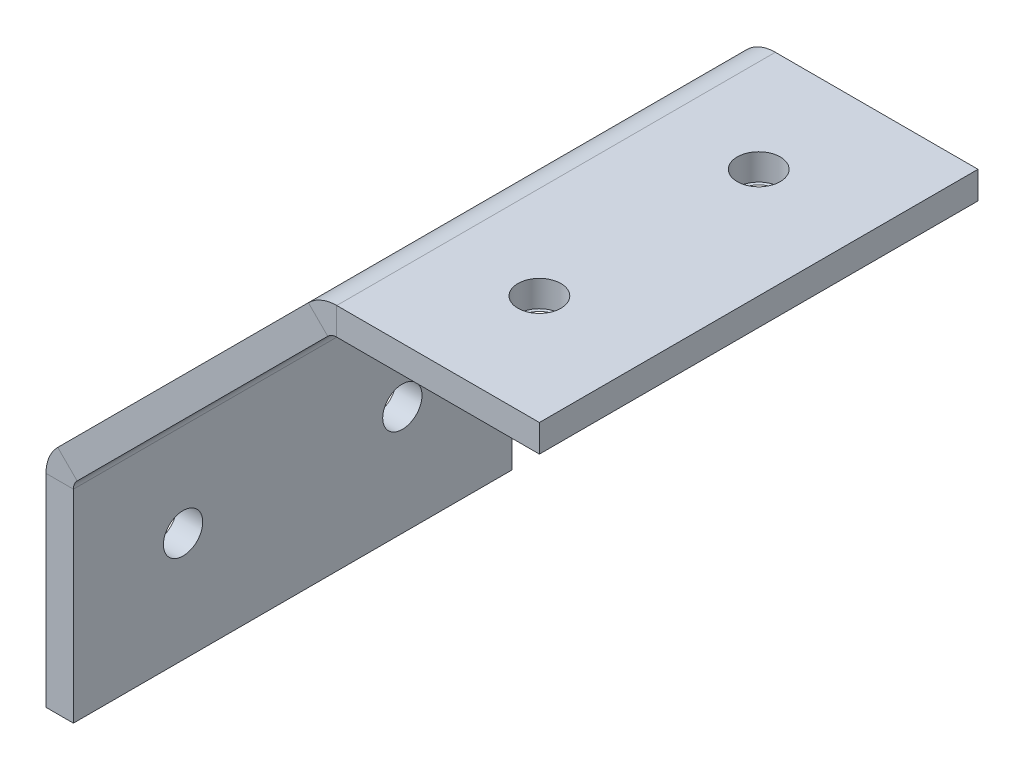
ISO-10303-21;
HEADER;
FILE_DESCRIPTION(('STEP AP214'),'2;1');
FILE_NAME('part.step','',(''),(''),'','','');
FILE_SCHEMA(('AUTOMOTIVE_DESIGN { 1 0 10303 214 1 1 1 1 }'));
ENDSEC;
DATA;
#1=APPLICATION_CONTEXT('core data for automotive mechanical design processes');
#2=APPLICATION_PROTOCOL_DEFINITION('international standard','automotive_design',2000,#1);
#3=PRODUCT_CONTEXT('',#1,'mechanical');
#4=PRODUCT('Part','Part','',(#3));
#5=PRODUCT_RELATED_PRODUCT_CATEGORY('part','',(#4));
#6=PRODUCT_DEFINITION_FORMATION('','',#4);
#7=PRODUCT_DEFINITION_CONTEXT('part definition',#1,'design');
#8=PRODUCT_DEFINITION('design','',#6,#7);
#9=PRODUCT_DEFINITION_SHAPE('','',#8);
#10=(LENGTH_UNIT() NAMED_UNIT(*) SI_UNIT(.MILLI.,.METRE.));
#11=(NAMED_UNIT(*) PLANE_ANGLE_UNIT() SI_UNIT($,.RADIAN.));
#12=(NAMED_UNIT(*) SI_UNIT($,.STERADIAN.) SOLID_ANGLE_UNIT());
#13=UNCERTAINTY_MEASURE_WITH_UNIT(LENGTH_MEASURE(1.E-05),#10,'distance_accuracy_value','');
#14=(GEOMETRIC_REPRESENTATION_CONTEXT(3) GLOBAL_UNCERTAINTY_ASSIGNED_CONTEXT((#13)) GLOBAL_UNIT_ASSIGNED_CONTEXT((#10,
#11,#12)) REPRESENTATION_CONTEXT('',''));
#15=CARTESIAN_POINT('',(0.,0.,0.));
#16=DIRECTION('',(0.,0.,1.));
#17=DIRECTION('',(1.,0.,0.));
#18=AXIS2_PLACEMENT_3D('',#15,#16,#17);
#19=CARTESIAN_POINT('',(16.8376737403113,0.,25.4));
#20=DIRECTION('',(0.,0.,1.));
#21=DIRECTION('',(1.,0.,0.));
#22=AXIS2_PLACEMENT_3D('',#19,#20,#21);
#23=PLANE('',#22);
#24=DIRECTION('',(0.,-1.,0.));
#25=VECTOR('',#24,1.);
#26=CARTESIAN_POINT('',(16.8376737403113,0.,25.4));
#27=LINE('',#26,#25);
#28=CARTESIAN_POINT('',(16.8376737403113,0.,25.4));
#29=VERTEX_POINT('',#28);
#30=CARTESIAN_POINT('',(16.8376737403113,-1.5875,25.4));
#31=VERTEX_POINT('',#30);
#32=EDGE_CURVE('E13',#29,#31,#27,.T.);
#33=ORIENTED_EDGE('',*,*,#32,.F.);
#34=CARTESIAN_POINT('',(16.8376737403113,-2.3241,25.4));
#35=DIRECTION('',(0.,0.,-1.));
#36=DIRECTION('',(-1.,0.,0.));
#37=AXIS2_PLACEMENT_3D('',#34,#35,#36);
#38=CIRCLE('',#37,2.3241);
#39=CARTESIAN_POINT('',(15.1942868701557,-0.680713129844343,25.4));
#40=VERTEX_POINT('',#39);
#41=EDGE_CURVE('E157',#29,#40,#38,.F.);
#42=ORIENTED_EDGE('',*,*,#41,.T.);
#43=DIRECTION('',(-0.707106781186547,0.707106781186548,0.));
#44=VECTOR('',#43,1.);
#45=CARTESIAN_POINT('',(16.3168188852893,-1.80324514497799,25.4));
#46=LINE('',#45,#44);
#47=CARTESIAN_POINT('',(16.3168188852893,-1.80324514497799,25.4));
#48=VERTEX_POINT('',#47);
#49=EDGE_CURVE('E54',#48,#40,#46,.T.);
#50=ORIENTED_EDGE('',*,*,#49,.F.);
#51=CARTESIAN_POINT('',(16.8376737403113,-2.3241,25.4));
#52=DIRECTION('',(0.,0.,1.));
#53=DIRECTION('',(1.,0.,0.));
#54=AXIS2_PLACEMENT_3D('',#51,#52,#53);
#55=CIRCLE('',#54,0.7366);
#56=EDGE_CURVE('E307',#31,#48,#55,.T.);
#57=ORIENTED_EDGE('',*,*,#56,.F.);
#58=EDGE_LOOP('',(#33,#42,#50,#57));
#59=FACE_BOUND('',#58,.T.);
#60=ADVANCED_FACE('F45',(#59),#23,.T.);
#61=CARTESIAN_POINT('',(16.3168188852893,-1.80324514497799,25.4));
#62=DIRECTION('',(0.,0.,1.));
#63=DIRECTION('',(1.,0.,0.));
#64=AXIS2_PLACEMENT_3D('',#61,#62,#63);
#65=PLANE('',#64);
#66=DIRECTION('',(-1.,0.,0.));
#67=VECTOR('',#66,1.);
#68=CARTESIAN_POINT('',(22.225,0.,25.4));
#69=LINE('',#68,#67);
#70=CARTESIAN_POINT('',(28.575,0.,25.4));
#71=VERTEX_POINT('',#70);
#72=EDGE_CURVE('E162',#71,#29,#69,.T.);
#73=ORIENTED_EDGE('',*,*,#72,.T.);
#74=ORIENTED_EDGE('',*,*,#32,.T.);
#75=DIRECTION('',(1.,0.,0.));
#76=VECTOR('',#75,1.);
#77=CARTESIAN_POINT('',(15.875,-1.5875,25.4));
#78=LINE('',#77,#76);
#79=CARTESIAN_POINT('',(28.575,-1.5875,25.4));
#80=VERTEX_POINT('',#79);
#81=EDGE_CURVE('E309',#80,#31,#78,.F.);
#82=ORIENTED_EDGE('',*,*,#81,.F.);
#83=DIRECTION('',(0.,-1.,0.));
#84=VECTOR('',#83,1.);
#85=CARTESIAN_POINT('',(28.575,0.,25.4));
#86=LINE('',#85,#84);
#87=EDGE_CURVE('E312',#71,#80,#86,.T.);
#88=ORIENTED_EDGE('',*,*,#87,.F.);
#89=EDGE_LOOP('',(#73,#74,#82,#88));
#90=FACE_BOUND('',#89,.T.);
#91=ADVANCED_FACE('F318',(#90),#65,.T.);
#92=CARTESIAN_POINT('',(15.1942868701557,-0.680713129844343,0.));
#93=DIRECTION('',(0.,0.,-1.));
#94=DIRECTION('',(-1.,0.,0.));
#95=AXIS2_PLACEMENT_3D('',#92,#93,#94);
#96=PLANE('',#95);
#97=DIRECTION('',(0.707106781186547,-0.707106781186548,0.));
#98=VECTOR('',#97,1.);
#99=CARTESIAN_POINT('',(15.1942868701557,-0.680713129844343,0.));
#100=LINE('',#99,#98);
#101=CARTESIAN_POINT('',(15.1942868701557,-0.680713129844343,0.));
#102=VERTEX_POINT('',#101);
#103=CARTESIAN_POINT('',(16.3168188852893,-1.80324514497799,0.));
#104=VERTEX_POINT('',#103);
#105=EDGE_CURVE('E154',#102,#104,#100,.T.);
#106=ORIENTED_EDGE('',*,*,#105,.F.);
#107=CARTESIAN_POINT('',(16.8376737403113,-2.3241,0.));
#108=DIRECTION('',(0.,0.,-1.));
#109=DIRECTION('',(-1.,0.,0.));
#110=AXIS2_PLACEMENT_3D('',#107,#108,#109);
#111=CIRCLE('',#110,2.3241);
#112=CARTESIAN_POINT('',(16.8376737403113,0.,0.));
#113=VERTEX_POINT('',#112);
#114=EDGE_CURVE('E169',#113,#102,#111,.F.);
#115=ORIENTED_EDGE('',*,*,#114,.F.);
#116=DIRECTION('',(0.,1.,0.));
#117=VECTOR('',#116,1.);
#118=CARTESIAN_POINT('',(16.8376737403113,-1.5875,0.));
#119=LINE('',#118,#117);
#120=CARTESIAN_POINT('',(16.8376737403113,-1.5875,0.));
#121=VERTEX_POINT('',#120);
#122=EDGE_CURVE('E245',#121,#113,#119,.T.);
#123=ORIENTED_EDGE('',*,*,#122,.F.);
#124=CARTESIAN_POINT('',(16.8376737403113,-2.3241,0.));
#125=DIRECTION('',(0.,0.,1.));
#126=DIRECTION('',(1.,0.,0.));
#127=AXIS2_PLACEMENT_3D('',#124,#125,#126);
#128=CIRCLE('',#127,0.7366);
#129=EDGE_CURVE('E194',#121,#104,#128,.T.);
#130=ORIENTED_EDGE('',*,*,#129,.T.);
#131=EDGE_LOOP('',(#106,#115,#123,#130));
#132=FACE_BOUND('',#131,.T.);
#133=ADVANCED_FACE('F323',(#132),#96,.T.);
#134=CARTESIAN_POINT('',(16.8376737403113,-1.5875,0.));
#135=DIRECTION('',(0.,0.,-1.));
#136=DIRECTION('',(-1.,0.,0.));
#137=AXIS2_PLACEMENT_3D('',#134,#135,#136);
#138=PLANE('',#137);
#139=DIRECTION('',(-0.707106781186548,-0.707106781186548,0.));
#140=VECTOR('',#139,1.);
#141=CARTESIAN_POINT('',(15.875,0.,0.));
#142=LINE('',#141,#140);
#143=CARTESIAN_POINT('',(0.680713129844338,-15.1942868701557,0.));
#144=VERTEX_POINT('',#143);
#145=EDGE_CURVE('E207',#102,#144,#142,.T.);
#146=ORIENTED_EDGE('',*,*,#145,.F.);
#147=ORIENTED_EDGE('',*,*,#105,.T.);
#148=DIRECTION('',(-0.707106781186548,-0.707106781186548,0.));
#149=VECTOR('',#148,1.);
#150=CARTESIAN_POINT('',(16.9975320151336,-1.12253201513364,0.));
#151=LINE('',#150,#149);
#152=CARTESIAN_POINT('',(1.80324514497799,-16.3168188852893,0.));
#153=VERTEX_POINT('',#152);
#154=EDGE_CURVE('E192',#104,#153,#151,.T.);
#155=ORIENTED_EDGE('',*,*,#154,.T.);
#156=DIRECTION('',(-0.707106781186549,0.707106781186546,0.));
#157=VECTOR('',#156,1.);
#158=CARTESIAN_POINT('',(1.80324514497799,-16.3168188852893,0.));
#159=LINE('',#158,#157);
#160=EDGE_CURVE('E104',#153,#144,#159,.T.);
#161=ORIENTED_EDGE('',*,*,#160,.T.);
#162=EDGE_LOOP('',(#146,#147,#155,#161));
#163=FACE_BOUND('',#162,.T.);
#164=ADVANCED_FACE('F325',(#163),#138,.T.);
#165=CARTESIAN_POINT('',(0.680713129844338,-15.1942868701557,25.4));
#166=DIRECTION('',(0.,0.,1.));
#167=DIRECTION('',(1.,0.,0.));
#168=AXIS2_PLACEMENT_3D('',#165,#166,#167);
#169=PLANE('',#168);
#170=DIRECTION('',(0.707106781186549,-0.707106781186546,0.));
#171=VECTOR('',#170,1.);
#172=CARTESIAN_POINT('',(0.680713129844338,-15.1942868701557,25.4));
#173=LINE('',#172,#171);
#174=CARTESIAN_POINT('',(0.680713129844338,-15.1942868701557,25.4));
#175=VERTEX_POINT('',#174);
#176=CARTESIAN_POINT('',(1.80324514497799,-16.3168188852893,25.4));
#177=VERTEX_POINT('',#176);
#178=EDGE_CURVE('E243',#175,#177,#173,.T.);
#179=ORIENTED_EDGE('',*,*,#178,.F.);
#180=CARTESIAN_POINT('',(2.3241,-16.8376737403113,25.4));
#181=DIRECTION('',(0.,0.,-1.));
#182=DIRECTION('',(-1.,0.,0.));
#183=AXIS2_PLACEMENT_3D('',#180,#181,#182);
#184=CIRCLE('',#183,2.3241);
#185=CARTESIAN_POINT('',(0.,-16.8376737403113,25.4));
#186=VERTEX_POINT('',#185);
#187=EDGE_CURVE('E177',#175,#186,#184,.F.);
#188=ORIENTED_EDGE('',*,*,#187,.T.);
#189=DIRECTION('',(-1.,0.,0.));
#190=VECTOR('',#189,1.);
#191=CARTESIAN_POINT('',(1.5875,-16.8376737403113,25.4));
#192=LINE('',#191,#190);
#193=CARTESIAN_POINT('',(1.5875,-16.8376737403113,25.4));
#194=VERTEX_POINT('',#193);
#195=EDGE_CURVE('E63',#194,#186,#192,.T.);
#196=ORIENTED_EDGE('',*,*,#195,.F.);
#197=CARTESIAN_POINT('',(2.3241,-16.8376737403113,25.4));
#198=DIRECTION('',(0.,0.,1.));
#199=DIRECTION('',(1.,0.,0.));
#200=AXIS2_PLACEMENT_3D('',#197,#198,#199);
#201=CIRCLE('',#200,0.7366);
#202=EDGE_CURVE('E303',#177,#194,#201,.T.);
#203=ORIENTED_EDGE('',*,*,#202,.F.);
#204=EDGE_LOOP('',(#179,#188,#196,#203));
#205=FACE_BOUND('',#204,.T.);
#206=ADVANCED_FACE('F354',(#205),#169,.T.);
#207=CARTESIAN_POINT('',(1.5875,-16.8376737403113,25.4));
#208=DIRECTION('',(0.,0.,1.));
#209=DIRECTION('',(1.,0.,0.));
#210=AXIS2_PLACEMENT_3D('',#207,#208,#209);
#211=PLANE('',#210);
#212=DIRECTION('',(-0.707106781186548,-0.707106781186548,0.));
#213=VECTOR('',#212,1.);
#214=CARTESIAN_POINT('',(15.875,0.,25.4));
#215=LINE('',#214,#213);
#216=EDGE_CURVE('E146',#40,#175,#215,.T.);
#217=ORIENTED_EDGE('',*,*,#216,.T.);
#218=ORIENTED_EDGE('',*,*,#178,.T.);
#219=DIRECTION('',(-0.707106781186548,-0.707106781186548,0.));
#220=VECTOR('',#219,1.);
#221=CARTESIAN_POINT('',(16.9975320151336,-1.12253201513364,25.4));
#222=LINE('',#221,#220);
#223=EDGE_CURVE('E149',#48,#177,#222,.T.);
#224=ORIENTED_EDGE('',*,*,#223,.F.);
#225=ORIENTED_EDGE('',*,*,#49,.T.);
#226=EDGE_LOOP('',(#217,#218,#224,#225));
#227=FACE_BOUND('',#226,.T.);
#228=ADVANCED_FACE('F144',(#227),#211,.T.);
#229=CARTESIAN_POINT('',(0.,-16.8376737403113,0.));
#230=DIRECTION('',(0.,0.,-1.));
#231=DIRECTION('',(-1.,0.,0.));
#232=AXIS2_PLACEMENT_3D('',#229,#230,#231);
#233=PLANE('',#232);
#234=DIRECTION('',(1.,0.,0.));
#235=VECTOR('',#234,1.);
#236=CARTESIAN_POINT('',(0.,-16.8376737403113,0.));
#237=LINE('',#236,#235);
#238=CARTESIAN_POINT('',(0.,-16.8376737403113,0.));
#239=VERTEX_POINT('',#238);
#240=CARTESIAN_POINT('',(1.5875,-16.8376737403113,0.));
#241=VERTEX_POINT('',#240);
#242=EDGE_CURVE('E111',#239,#241,#237,.T.);
#243=ORIENTED_EDGE('',*,*,#242,.F.);
#244=CARTESIAN_POINT('',(2.3241,-16.8376737403113,0.));
#245=DIRECTION('',(0.,0.,-1.));
#246=DIRECTION('',(-1.,0.,0.));
#247=AXIS2_PLACEMENT_3D('',#244,#245,#246);
#248=CIRCLE('',#247,2.3241);
#249=EDGE_CURVE('E209',#144,#239,#248,.F.);
#250=ORIENTED_EDGE('',*,*,#249,.F.);
#251=ORIENTED_EDGE('',*,*,#160,.F.);
#252=CARTESIAN_POINT('',(2.3241,-16.8376737403113,0.));
#253=DIRECTION('',(0.,0.,1.));
#254=DIRECTION('',(1.,0.,0.));
#255=AXIS2_PLACEMENT_3D('',#252,#253,#254);
#256=CIRCLE('',#255,0.7366);
#257=EDGE_CURVE('E190',#153,#241,#256,.T.);
#258=ORIENTED_EDGE('',*,*,#257,.T.);
#259=EDGE_LOOP('',(#243,#250,#251,#258));
#260=FACE_BOUND('',#259,.T.);
#261=ADVANCED_FACE('F338',(#260),#233,.T.);
#262=CARTESIAN_POINT('',(1.80324514497799,-16.3168188852893,0.));
#263=DIRECTION('',(0.,0.,-1.));
#264=DIRECTION('',(-1.,0.,0.));
#265=AXIS2_PLACEMENT_3D('',#262,#263,#264);
#266=PLANE('',#265);
#267=DIRECTION('',(0.,-1.,0.));
#268=VECTOR('',#267,1.);
#269=CARTESIAN_POINT('',(0.,-15.875,0.));
#270=LINE('',#269,#268);
#271=CARTESIAN_POINT('',(0.,-28.575,0.));
#272=VERTEX_POINT('',#271);
#273=EDGE_CURVE('E211',#239,#272,#270,.T.);
#274=ORIENTED_EDGE('',*,*,#273,.F.);
#275=ORIENTED_EDGE('',*,*,#242,.T.);
#276=DIRECTION('',(0.,-1.,0.));
#277=VECTOR('',#276,1.);
#278=CARTESIAN_POINT('',(1.5875,-15.875,0.));
#279=LINE('',#278,#277);
#280=CARTESIAN_POINT('',(1.5875,-28.575,0.));
#281=VERTEX_POINT('',#280);
#282=EDGE_CURVE('E187',#241,#281,#279,.T.);
#283=ORIENTED_EDGE('',*,*,#282,.T.);
#284=DIRECTION('',(-1.,0.,0.));
#285=VECTOR('',#284,1.);
#286=CARTESIAN_POINT('',(1.5875,-28.575,0.));
#287=LINE('',#286,#285);
#288=EDGE_CURVE('E184',#281,#272,#287,.T.);
#289=ORIENTED_EDGE('',*,*,#288,.T.);
#290=EDGE_LOOP('',(#274,#275,#283,#289));
#291=FACE_BOUND('',#290,.T.);
#292=ADVANCED_FACE('F346',(#291),#266,.T.);
#293=CARTESIAN_POINT('',(1.5875,-28.575,25.4));
#294=DIRECTION('',(0.,-1.,0.));
#295=DIRECTION('',(0.,0.,-1.));
#296=AXIS2_PLACEMENT_3D('',#293,#294,#295);
#297=PLANE('',#296);
#298=ORIENTED_EDGE('',*,*,#288,.F.);
#299=DIRECTION('',(0.,0.,-1.));
#300=VECTOR('',#299,1.);
#301=CARTESIAN_POINT('',(1.5875,-28.575,25.4));
#302=LINE('',#301,#300);
#303=CARTESIAN_POINT('',(1.5875,-28.575,25.4));
#304=VERTEX_POINT('',#303);
#305=EDGE_CURVE('E234',#304,#281,#302,.T.);
#306=ORIENTED_EDGE('',*,*,#305,.F.);
#307=DIRECTION('',(-1.,0.,0.));
#308=VECTOR('',#307,1.);
#309=CARTESIAN_POINT('',(1.5875,-28.575,25.4));
#310=LINE('',#309,#308);
#311=CARTESIAN_POINT('',(0.,-28.575,25.4));
#312=VERTEX_POINT('',#311);
#313=EDGE_CURVE('E297',#304,#312,#310,.T.);
#314=ORIENTED_EDGE('',*,*,#313,.T.);
#315=DIRECTION('',(0.,0.,-1.));
#316=VECTOR('',#315,1.);
#317=CARTESIAN_POINT('',(0.,-28.575,25.4));
#318=LINE('',#317,#316);
#319=EDGE_CURVE('E237',#312,#272,#318,.T.);
#320=ORIENTED_EDGE('',*,*,#319,.T.);
#321=EDGE_LOOP('',(#298,#306,#314,#320));
#322=FACE_BOUND('',#321,.T.);
#323=ADVANCED_FACE('F349',(#322),#297,.T.);
#324=CARTESIAN_POINT('',(1.5875,-15.875,25.4));
#325=DIRECTION('',(1.,0.,0.));
#326=DIRECTION('',(0.,1.,0.));
#327=AXIS2_PLACEMENT_3D('',#324,#325,#326);
#328=PLANE('',#327);
#329=CARTESIAN_POINT('',(1.5875,-22.225,19.05));
#330=DIRECTION('',(1.,0.,0.));
#331=DIRECTION('',(0.,1.,0.));
#332=AXIS2_PLACEMENT_3D('',#329,#330,#331);
#333=CIRCLE('',#332,1.13891825287073);
#334=CARTESIAN_POINT('',(1.5875,-21.0860817471293,19.05));
#335=VERTEX_POINT('',#334);
#336=EDGE_CURVE('E48',#335,#335,#333,.T.);
#337=ORIENTED_EDGE('',*,*,#336,.F.);
#338=EDGE_LOOP('',(#337));
#339=FACE_BOUND('',#338,.T.);
#340=CARTESIAN_POINT('',(1.5875,-22.225,6.35));
#341=DIRECTION('',(1.,0.,0.));
#342=DIRECTION('',(0.,1.,0.));
#343=AXIS2_PLACEMENT_3D('',#340,#341,#342);
#344=CIRCLE('',#343,1.13891825287073);
#345=CARTESIAN_POINT('',(1.5875,-21.0860817471293,6.35));
#346=VERTEX_POINT('',#345);
#347=EDGE_CURVE('E265',#346,#346,#344,.T.);
#348=ORIENTED_EDGE('',*,*,#347,.F.);
#349=EDGE_LOOP('',(#348));
#350=FACE_BOUND('',#349,.T.);
#351=ORIENTED_EDGE('',*,*,#282,.F.);
#352=DIRECTION('',(0.,0.,-1.));
#353=VECTOR('',#352,1.);
#354=CARTESIAN_POINT('',(1.5875,-16.8376737403113,25.4));
#355=LINE('',#354,#353);
#356=EDGE_CURVE('E231',#194,#241,#355,.T.);
#357=ORIENTED_EDGE('',*,*,#356,.F.);
#358=DIRECTION('',(0.,-1.,0.));
#359=VECTOR('',#358,1.);
#360=CARTESIAN_POINT('',(1.5875,-22.225,25.4));
#361=LINE('',#360,#359);
#362=EDGE_CURVE('E300',#194,#304,#361,.T.);
#363=ORIENTED_EDGE('',*,*,#362,.T.);
#364=ORIENTED_EDGE('',*,*,#305,.T.);
#365=EDGE_LOOP('',(#351,#357,#363,#364));
#366=FACE_BOUND('',#365,.T.);
#367=ADVANCED_FACE('F352',(#339,#350,#366),#328,.T.);
#368=CARTESIAN_POINT('',(2.3241,-16.8376737403113,25.4));
#369=DIRECTION('',(0.,0.,-1.));
#370=DIRECTION('',(-1.,0.,0.));
#371=AXIS2_PLACEMENT_3D('',#368,#369,#370);
#372=CYLINDRICAL_SURFACE('',#371,0.7366);
#373=ORIENTED_EDGE('',*,*,#257,.F.);
#374=DIRECTION('',(0.,0.,-1.));
#375=VECTOR('',#374,1.);
#376=CARTESIAN_POINT('',(1.80324514497799,-16.3168188852893,25.4));
#377=LINE('',#376,#375);
#378=EDGE_CURVE('E228',#177,#153,#377,.T.);
#379=ORIENTED_EDGE('',*,*,#378,.F.);
#380=ORIENTED_EDGE('',*,*,#202,.T.);
#381=ORIENTED_EDGE('',*,*,#356,.T.);
#382=EDGE_LOOP('',(#373,#379,#380,#381));
#383=FACE_BOUND('',#382,.T.);
#384=ADVANCED_FACE('F335',(#383),#372,.F.);
#385=CARTESIAN_POINT('',(16.9975320151336,-1.12253201513364,25.4));
#386=DIRECTION('',(0.707106781186548,-0.707106781186548,0.));
#387=DIRECTION('',(0.707106781186548,0.707106781186548,0.));
#388=AXIS2_PLACEMENT_3D('',#385,#386,#387);
#389=PLANE('',#388);
#390=CARTESIAN_POINT('',(9.06003201513364,-9.06003201513364,6.35));
#391=DIRECTION('',(0.707106781186548,-0.707106781186548,0.));
#392=DIRECTION('',(0.707106781186548,0.707106781186548,0.));
#393=AXIS2_PLACEMENT_3D('',#390,#391,#392);
#394=CIRCLE('',#393,1.13891825287073);
#395=CARTESIAN_POINT('',(9.86536883495567,-8.25469519531161,6.35));
#396=VERTEX_POINT('',#395);
#397=EDGE_CURVE('E261',#396,#396,#394,.T.);
#398=ORIENTED_EDGE('',*,*,#397,.F.);
#399=EDGE_LOOP('',(#398));
#400=FACE_BOUND('',#399,.T.);
#401=CARTESIAN_POINT('',(9.06003201513364,-9.06003201513364,19.05));
#402=DIRECTION('',(0.707106781186548,-0.707106781186548,0.));
#403=DIRECTION('',(0.707106781186548,0.707106781186548,0.));
#404=AXIS2_PLACEMENT_3D('',#401,#402,#403);
#405=CIRCLE('',#404,1.13891825287073);
#406=CARTESIAN_POINT('',(9.86536883495567,-8.25469519531161,19.05));
#407=VERTEX_POINT('',#406);
#408=EDGE_CURVE('E256',#407,#407,#405,.T.);
#409=ORIENTED_EDGE('',*,*,#408,.F.);
#410=EDGE_LOOP('',(#409));
#411=FACE_BOUND('',#410,.T.);
#412=ORIENTED_EDGE('',*,*,#154,.F.);
#413=DIRECTION('',(0.,0.,-1.));
#414=VECTOR('',#413,1.);
#415=CARTESIAN_POINT('',(16.3168188852893,-1.80324514497799,25.4));
#416=LINE('',#415,#414);
#417=EDGE_CURVE('E225',#48,#104,#416,.T.);
#418=ORIENTED_EDGE('',*,*,#417,.F.);
#419=ORIENTED_EDGE('',*,*,#223,.T.);
#420=ORIENTED_EDGE('',*,*,#378,.T.);
#421=EDGE_LOOP('',(#412,#418,#419,#420));
#422=FACE_BOUND('',#421,.T.);
#423=ADVANCED_FACE('F330',(#400,#411,#422),#389,.T.);
#424=CARTESIAN_POINT('',(16.8376737403113,-2.3241,25.4));
#425=DIRECTION('',(0.,0.,-1.));
#426=DIRECTION('',(-1.,0.,0.));
#427=AXIS2_PLACEMENT_3D('',#424,#425,#426);
#428=CYLINDRICAL_SURFACE('',#427,0.7366);
#429=ORIENTED_EDGE('',*,*,#129,.F.);
#430=DIRECTION('',(0.,0.,-1.));
#431=VECTOR('',#430,1.);
#432=CARTESIAN_POINT('',(16.8376737403113,-1.5875,25.4));
#433=LINE('',#432,#431);
#434=EDGE_CURVE('E222',#31,#121,#433,.T.);
#435=ORIENTED_EDGE('',*,*,#434,.F.);
#436=ORIENTED_EDGE('',*,*,#56,.T.);
#437=ORIENTED_EDGE('',*,*,#417,.T.);
#438=EDGE_LOOP('',(#429,#435,#436,#437));
#439=FACE_BOUND('',#438,.T.);
#440=ADVANCED_FACE('F328',(#439),#428,.F.);
#441=CARTESIAN_POINT('',(22.225,-1.5875,25.4));
#442=DIRECTION('',(0.,-1.,0.));
#443=DIRECTION('',(0.,0.,-1.));
#444=AXIS2_PLACEMENT_3D('',#441,#442,#443);
#445=PLANE('',#444);
#446=CARTESIAN_POINT('',(22.225,-1.5875,6.35));
#447=DIRECTION('',(0.,-1.,0.));
#448=DIRECTION('',(0.,0.,-1.));
#449=AXIS2_PLACEMENT_3D('',#446,#447,#448);
#450=CIRCLE('',#449,1.13891825287073);
#451=CARTESIAN_POINT('',(22.225,-1.5875,5.21108174712927));
#452=VERTEX_POINT('',#451);
#453=EDGE_CURVE('E251',#452,#452,#450,.T.);
#454=ORIENTED_EDGE('',*,*,#453,.F.);
#455=EDGE_LOOP('',(#454));
#456=FACE_BOUND('',#455,.T.);
#457=CARTESIAN_POINT('',(22.225,-1.5875,19.05));
#458=DIRECTION('',(0.,-1.,0.));
#459=DIRECTION('',(0.,0.,-1.));
#460=AXIS2_PLACEMENT_3D('',#457,#458,#459);
#461=CIRCLE('',#460,1.13891825287073);
#462=CARTESIAN_POINT('',(22.225,-1.5875,17.9110817471293));
#463=VERTEX_POINT('',#462);
#464=EDGE_CURVE('E188',#463,#463,#461,.T.);
#465=ORIENTED_EDGE('',*,*,#464,.F.);
#466=EDGE_LOOP('',(#465));
#467=FACE_BOUND('',#466,.T.);
#468=DIRECTION('',(1.,0.,0.));
#469=VECTOR('',#468,1.);
#470=CARTESIAN_POINT('',(22.225,-1.5875,0.));
#471=LINE('',#470,#469);
#472=CARTESIAN_POINT('',(28.575,-1.5875,0.));
#473=VERTEX_POINT('',#472);
#474=EDGE_CURVE('E197',#473,#121,#471,.F.);
#475=ORIENTED_EDGE('',*,*,#474,.F.);
#476=DIRECTION('',(0.,0.,-1.));
#477=VECTOR('',#476,1.);
#478=CARTESIAN_POINT('',(28.575,-1.5875,25.4));
#479=LINE('',#478,#477);
#480=EDGE_CURVE('E220',#80,#473,#479,.T.);
#481=ORIENTED_EDGE('',*,*,#480,.F.);
#482=ORIENTED_EDGE('',*,*,#81,.T.);
#483=ORIENTED_EDGE('',*,*,#434,.T.);
#484=EDGE_LOOP('',(#475,#481,#482,#483));
#485=FACE_BOUND('',#484,.T.);
#486=ADVANCED_FACE('F440',(#456,#467,#485),#445,.T.);
#487=CARTESIAN_POINT('',(28.575,0.,25.4));
#488=DIRECTION('',(1.,0.,0.));
#489=DIRECTION('',(0.,0.,-1.));
#490=AXIS2_PLACEMENT_3D('',#487,#488,#489);
#491=PLANE('',#490);
#492=DIRECTION('',(0.,-1.,0.));
#493=VECTOR('',#492,1.);
#494=CARTESIAN_POINT('',(28.575,0.,0.));
#495=LINE('',#494,#493);
#496=CARTESIAN_POINT('',(28.575,0.,0.));
#497=VERTEX_POINT('',#496);
#498=EDGE_CURVE('E200',#497,#473,#495,.T.);
#499=ORIENTED_EDGE('',*,*,#498,.F.);
#500=DIRECTION('',(0.,0.,-1.));
#501=VECTOR('',#500,1.);
#502=CARTESIAN_POINT('',(28.575,0.,25.4));
#503=LINE('',#502,#501);
#504=EDGE_CURVE('E217',#71,#497,#503,.T.);
#505=ORIENTED_EDGE('',*,*,#504,.F.);
#506=ORIENTED_EDGE('',*,*,#87,.T.);
#507=ORIENTED_EDGE('',*,*,#480,.T.);
#508=EDGE_LOOP('',(#499,#505,#506,#507));
#509=FACE_BOUND('',#508,.T.);
#510=ADVANCED_FACE('F448',(#509),#491,.T.);
#511=CARTESIAN_POINT('',(15.875,0.,25.4));
#512=DIRECTION('',(0.,-1.,0.));
#513=DIRECTION('',(0.,0.,-1.));
#514=AXIS2_PLACEMENT_3D('',#511,#512,#513);
#515=PLANE('',#514);
#516=CARTESIAN_POINT('',(22.225,0.,6.35));
#517=DIRECTION('',(0.,1.,0.));
#518=DIRECTION('',(0.,0.,1.));
#519=AXIS2_PLACEMENT_3D('',#516,#517,#518);
#520=CIRCLE('',#519,1.24459999999999);
#521=CARTESIAN_POINT('',(22.225,0.,7.59459999999999));
#522=VERTEX_POINT('',#521);
#523=EDGE_CURVE('E259',#522,#522,#520,.T.);
#524=ORIENTED_EDGE('',*,*,#523,.F.);
#525=EDGE_LOOP('',(#524));
#526=FACE_BOUND('',#525,.T.);
#527=CARTESIAN_POINT('',(22.225,0.,19.05));
#528=DIRECTION('',(0.,1.,0.));
#529=DIRECTION('',(0.,0.,1.));
#530=AXIS2_PLACEMENT_3D('',#527,#528,#529);
#531=CIRCLE('',#530,1.24459999999999);
#532=CARTESIAN_POINT('',(22.225,0.,20.2946));
#533=VERTEX_POINT('',#532);
#534=EDGE_CURVE('E254',#533,#533,#531,.T.);
#535=ORIENTED_EDGE('',*,*,#534,.F.);
#536=EDGE_LOOP('',(#535));
#537=FACE_BOUND('',#536,.T.);
#538=DIRECTION('',(-1.,0.,0.));
#539=VECTOR('',#538,1.);
#540=CARTESIAN_POINT('',(15.875,0.,0.));
#541=LINE('',#540,#539);
#542=EDGE_CURVE('E203',#497,#113,#541,.T.);
#543=ORIENTED_EDGE('',*,*,#542,.T.);
#544=DIRECTION('',(0.,0.,-1.));
#545=VECTOR('',#544,1.);
#546=CARTESIAN_POINT('',(16.8376737403113,0.,25.4));
#547=LINE('',#546,#545);
#548=EDGE_CURVE('E171',#29,#113,#547,.T.);
#549=ORIENTED_EDGE('',*,*,#548,.F.);
#550=ORIENTED_EDGE('',*,*,#72,.F.);
#551=ORIENTED_EDGE('',*,*,#504,.T.);
#552=EDGE_LOOP('',(#543,#549,#550,#551));
#553=FACE_BOUND('',#552,.T.);
#554=ADVANCED_FACE('F321',(#526,#537,#553),#515,.F.);
#555=CARTESIAN_POINT('',(16.8376737403113,-2.3241,25.4));
#556=DIRECTION('',(0.,0.,-1.));
#557=DIRECTION('',(-1.,0.,0.));
#558=AXIS2_PLACEMENT_3D('',#555,#556,#557);
#559=CYLINDRICAL_SURFACE('',#558,2.3241);
#560=ORIENTED_EDGE('',*,*,#114,.T.);
#561=DIRECTION('',(0.,0.,-1.));
#562=VECTOR('',#561,1.);
#563=CARTESIAN_POINT('',(15.1942868701557,-0.680713129844343,25.4));
#564=LINE('',#563,#562);
#565=EDGE_CURVE('E166',#40,#102,#564,.T.);
#566=ORIENTED_EDGE('',*,*,#565,.F.);
#567=ORIENTED_EDGE('',*,*,#41,.F.);
#568=ORIENTED_EDGE('',*,*,#548,.T.);
#569=EDGE_LOOP('',(#560,#566,#567,#568));
#570=FACE_BOUND('',#569,.T.);
#571=ADVANCED_FACE('F167',(#570),#559,.T.);
#572=CARTESIAN_POINT('',(15.875,0.,25.4));
#573=DIRECTION('',(0.707106781186548,-0.707106781186548,0.));
#574=DIRECTION('',(0.707106781186548,0.707106781186548,0.));
#575=AXIS2_PLACEMENT_3D('',#572,#573,#574);
#576=PLANE('',#575);
#577=CARTESIAN_POINT('',(7.9375,-7.9375,6.35));
#578=DIRECTION('',(-0.707106781186548,0.707106781186547,0.));
#579=DIRECTION('',(-0.707106781186547,-0.707106781186548,0.));
#580=AXIS2_PLACEMENT_3D('',#577,#578,#579);
#581=CIRCLE('',#580,1.24459999999999);
#582=CARTESIAN_POINT('',(7.05743490013523,-8.81756509986477,6.35));
#583=VERTEX_POINT('',#582);
#584=EDGE_CURVE('E267',#583,#583,#581,.T.);
#585=ORIENTED_EDGE('',*,*,#584,.F.);
#586=EDGE_LOOP('',(#585));
#587=FACE_BOUND('',#586,.T.);
#588=CARTESIAN_POINT('',(7.9375,-7.9375,19.05));
#589=DIRECTION('',(-0.707106781186548,0.707106781186547,0.));
#590=DIRECTION('',(-0.707106781186547,-0.707106781186548,0.));
#591=AXIS2_PLACEMENT_3D('',#588,#589,#590);
#592=CIRCLE('',#591,1.24459999999999);
#593=CARTESIAN_POINT('',(7.05743490013523,-8.81756509986477,19.05));
#594=VERTEX_POINT('',#593);
#595=EDGE_CURVE('E263',#594,#594,#592,.T.);
#596=ORIENTED_EDGE('',*,*,#595,.F.);
#597=EDGE_LOOP('',(#596));
#598=FACE_BOUND('',#597,.T.);
#599=ORIENTED_EDGE('',*,*,#145,.T.);
#600=DIRECTION('',(0.,0.,-1.));
#601=VECTOR('',#600,1.);
#602=CARTESIAN_POINT('',(0.680713129844338,-15.1942868701557,25.4));
#603=LINE('',#602,#601);
#604=EDGE_CURVE('E172',#175,#144,#603,.T.);
#605=ORIENTED_EDGE('',*,*,#604,.F.);
#606=ORIENTED_EDGE('',*,*,#216,.F.);
#607=ORIENTED_EDGE('',*,*,#565,.T.);
#608=EDGE_LOOP('',(#599,#605,#606,#607));
#609=FACE_BOUND('',#608,.T.);
#610=ADVANCED_FACE('F174',(#587,#598,#609),#576,.F.);
#611=CARTESIAN_POINT('',(2.3241,-16.8376737403113,25.4));
#612=DIRECTION('',(0.,0.,-1.));
#613=DIRECTION('',(-1.,0.,0.));
#614=AXIS2_PLACEMENT_3D('',#611,#612,#613);
#615=CYLINDRICAL_SURFACE('',#614,2.3241);
#616=ORIENTED_EDGE('',*,*,#249,.T.);
#617=DIRECTION('',(0.,0.,-1.));
#618=VECTOR('',#617,1.);
#619=CARTESIAN_POINT('',(0.,-16.8376737403113,25.4));
#620=LINE('',#619,#618);
#621=EDGE_CURVE('E180',#186,#239,#620,.T.);
#622=ORIENTED_EDGE('',*,*,#621,.F.);
#623=ORIENTED_EDGE('',*,*,#187,.F.);
#624=ORIENTED_EDGE('',*,*,#604,.T.);
#625=EDGE_LOOP('',(#616,#622,#623,#624));
#626=FACE_BOUND('',#625,.T.);
#627=ADVANCED_FACE('F341',(#626),#615,.T.);
#628=CARTESIAN_POINT('',(0.,-15.875,25.4));
#629=DIRECTION('',(1.,0.,0.));
#630=DIRECTION('',(0.,1.,0.));
#631=AXIS2_PLACEMENT_3D('',#628,#629,#630);
#632=PLANE('',#631);
#633=CARTESIAN_POINT('',(0.,-22.225,19.05));
#634=DIRECTION('',(-1.,0.,0.));
#635=DIRECTION('',(0.,0.,1.));
#636=AXIS2_PLACEMENT_3D('',#633,#634,#635);
#637=CIRCLE('',#636,1.24459999999999);
#638=CARTESIAN_POINT('',(0.,-22.225,20.2946));
#639=VERTEX_POINT('',#638);
#640=EDGE_CURVE('E674',#639,#639,#637,.T.);
#641=ORIENTED_EDGE('',*,*,#640,.F.);
#642=EDGE_LOOP('',(#641));
#643=FACE_BOUND('',#642,.T.);
#644=CARTESIAN_POINT('',(0.,-22.225,6.35));
#645=DIRECTION('',(-1.,0.,0.));
#646=DIRECTION('',(0.,0.,1.));
#647=AXIS2_PLACEMENT_3D('',#644,#645,#646);
#648=CIRCLE('',#647,1.24459999999999);
#649=CARTESIAN_POINT('',(0.,-22.225,7.59459999999999));
#650=VERTEX_POINT('',#649);
#651=EDGE_CURVE('E274',#650,#650,#648,.T.);
#652=ORIENTED_EDGE('',*,*,#651,.F.);
#653=EDGE_LOOP('',(#652));
#654=FACE_BOUND('',#653,.T.);
#655=ORIENTED_EDGE('',*,*,#273,.T.);
#656=ORIENTED_EDGE('',*,*,#319,.F.);
#657=DIRECTION('',(0.,-1.,0.));
#658=VECTOR('',#657,1.);
#659=CARTESIAN_POINT('',(0.,-22.225,25.4));
#660=LINE('',#659,#658);
#661=EDGE_CURVE('E116',#186,#312,#660,.T.);
#662=ORIENTED_EDGE('',*,*,#661,.F.);
#663=ORIENTED_EDGE('',*,*,#621,.T.);
#664=EDGE_LOOP('',(#655,#656,#662,#663));
#665=FACE_BOUND('',#664,.T.);
#666=ADVANCED_FACE('F344',(#643,#654,#665),#632,.F.);
#667=CARTESIAN_POINT('',(2.3241,-16.8376737403113,25.4));
#668=DIRECTION('',(0.,0.,1.));
#669=DIRECTION('',(1.,0.,0.));
#670=AXIS2_PLACEMENT_3D('',#667,#668,#669);
#671=PLANE('',#670);
#672=ORIENTED_EDGE('',*,*,#661,.T.);
#673=ORIENTED_EDGE('',*,*,#313,.F.);
#674=ORIENTED_EDGE('',*,*,#362,.F.);
#675=ORIENTED_EDGE('',*,*,#195,.T.);
#676=EDGE_LOOP('',(#672,#673,#674,#675));
#677=FACE_BOUND('',#676,.T.);
#678=ADVANCED_FACE('F350',(#677),#671,.T.);
#679=CARTESIAN_POINT('',(2.3241,-16.8376737403113,0.));
#680=DIRECTION('',(0.,0.,1.));
#681=DIRECTION('',(1.,0.,0.));
#682=AXIS2_PLACEMENT_3D('',#679,#680,#681);
#683=PLANE('',#682);
#684=ORIENTED_EDGE('',*,*,#474,.T.);
#685=ORIENTED_EDGE('',*,*,#122,.T.);
#686=ORIENTED_EDGE('',*,*,#542,.F.);
#687=ORIENTED_EDGE('',*,*,#498,.T.);
#688=EDGE_LOOP('',(#684,#685,#686,#687));
#689=FACE_BOUND('',#688,.T.);
#690=ADVANCED_FACE('F489',(#689),#683,.F.);
#691=CARTESIAN_POINT('',(22.225,-1.524,19.05));
#692=DIRECTION('',(0.,1.,0.));
#693=DIRECTION('',(0.,0.,1.));
#694=AXIS2_PLACEMENT_3D('',#691,#692,#693);
#695=CONICAL_SURFACE('',#694,1.24459999999999,1.02974425867665);
#696=ORIENTED_EDGE('',*,*,#464,.T.);
#697=EDGE_LOOP('',(#696));
#698=FACE_BOUND('',#697,.T.);
#699=CARTESIAN_POINT('',(22.225,-1.524,19.05));
#700=DIRECTION('',(0.,1.,0.));
#701=DIRECTION('',(0.,0.,1.));
#702=AXIS2_PLACEMENT_3D('',#699,#700,#701);
#703=CIRCLE('',#702,1.24459999999999);
#704=CARTESIAN_POINT('',(22.225,-1.524,20.2946));
#705=VERTEX_POINT('',#704);
#706=EDGE_CURVE('E250',#705,#705,#703,.T.);
#707=ORIENTED_EDGE('',*,*,#706,.T.);
#708=EDGE_LOOP('',(#707));
#709=FACE_BOUND('',#708,.T.);
#710=ADVANCED_FACE('F500',(#698,#709),#695,.F.);
#711=CARTESIAN_POINT('',(22.225,0.,19.05));
#712=DIRECTION('',(0.,1.,0.));
#713=DIRECTION('',(0.,0.,1.));
#714=AXIS2_PLACEMENT_3D('',#711,#712,#713);
#715=CYLINDRICAL_SURFACE('',#714,1.24459999999999);
#716=ORIENTED_EDGE('',*,*,#706,.F.);
#717=EDGE_LOOP('',(#716));
#718=FACE_BOUND('',#717,.T.);
#719=ORIENTED_EDGE('',*,*,#534,.T.);
#720=EDGE_LOOP('',(#719));
#721=FACE_BOUND('',#720,.T.);
#722=ADVANCED_FACE('F525',(#718,#721),#715,.F.);
#723=CARTESIAN_POINT('',(22.225,-1.524,6.35));
#724=DIRECTION('',(0.,1.,0.));
#725=DIRECTION('',(0.,0.,1.));
#726=AXIS2_PLACEMENT_3D('',#723,#724,#725);
#727=CONICAL_SURFACE('',#726,1.24459999999999,1.02974425867665);
#728=ORIENTED_EDGE('',*,*,#453,.T.);
#729=EDGE_LOOP('',(#728));
#730=FACE_BOUND('',#729,.T.);
#731=CARTESIAN_POINT('',(22.225,-1.524,6.35));
#732=DIRECTION('',(0.,1.,0.));
#733=DIRECTION('',(0.,0.,1.));
#734=AXIS2_PLACEMENT_3D('',#731,#732,#733);
#735=CIRCLE('',#734,1.24459999999999);
#736=CARTESIAN_POINT('',(22.225,-1.524,7.59459999999999));
#737=VERTEX_POINT('',#736);
#738=EDGE_CURVE('E255',#737,#737,#735,.T.);
#739=ORIENTED_EDGE('',*,*,#738,.T.);
#740=EDGE_LOOP('',(#739));
#741=FACE_BOUND('',#740,.T.);
#742=ADVANCED_FACE('F535',(#730,#741),#727,.F.);
#743=CARTESIAN_POINT('',(22.225,0.,6.35));
#744=DIRECTION('',(0.,1.,0.));
#745=DIRECTION('',(0.,0.,1.));
#746=AXIS2_PLACEMENT_3D('',#743,#744,#745);
#747=CYLINDRICAL_SURFACE('',#746,1.24459999999999);
#748=ORIENTED_EDGE('',*,*,#738,.F.);
#749=EDGE_LOOP('',(#748));
#750=FACE_BOUND('',#749,.T.);
#751=ORIENTED_EDGE('',*,*,#523,.T.);
#752=EDGE_LOOP('',(#751));
#753=FACE_BOUND('',#752,.T.);
#754=ADVANCED_FACE('F545',(#750,#753),#747,.F.);
#755=CARTESIAN_POINT('',(9.0151307345283,-9.0151307345283,19.05));
#756=DIRECTION('',(-0.707106781186548,0.707106781186547,0.));
#757=DIRECTION('',(-0.707106781186547,-0.707106781186548,0.));
#758=AXIS2_PLACEMENT_3D('',#755,#756,#757);
#759=CONICAL_SURFACE('',#758,1.24459999999999,1.02974425867666);
#760=ORIENTED_EDGE('',*,*,#408,.T.);
#761=EDGE_LOOP('',(#760));
#762=FACE_BOUND('',#761,.T.);
#763=CARTESIAN_POINT('',(9.0151307345283,-9.0151307345283,19.05));
#764=DIRECTION('',(-0.707106781186548,0.707106781186547,0.));
#765=DIRECTION('',(-0.707106781186547,-0.707106781186548,0.));
#766=AXIS2_PLACEMENT_3D('',#763,#764,#765);
#767=CIRCLE('',#766,1.24459999999999);
#768=CARTESIAN_POINT('',(8.13506563466353,-9.89519583439307,19.05));
#769=VERTEX_POINT('',#768);
#770=EDGE_CURVE('E260',#769,#769,#767,.T.);
#771=ORIENTED_EDGE('',*,*,#770,.T.);
#772=EDGE_LOOP('',(#771));
#773=FACE_BOUND('',#772,.T.);
#774=ADVANCED_FACE('F555',(#762,#773),#759,.F.);
#775=CARTESIAN_POINT('',(7.9375,-7.9375,19.05));
#776=DIRECTION('',(-0.707106781186548,0.707106781186547,0.));
#777=DIRECTION('',(-0.707106781186547,-0.707106781186548,0.));
#778=AXIS2_PLACEMENT_3D('',#775,#776,#777);
#779=CYLINDRICAL_SURFACE('',#778,1.24459999999999);
#780=ORIENTED_EDGE('',*,*,#770,.F.);
#781=EDGE_LOOP('',(#780));
#782=FACE_BOUND('',#781,.T.);
#783=ORIENTED_EDGE('',*,*,#595,.T.);
#784=EDGE_LOOP('',(#783));
#785=FACE_BOUND('',#784,.T.);
#786=ADVANCED_FACE('F581',(#782,#785),#779,.F.);
#787=CARTESIAN_POINT('',(9.0151307345283,-9.0151307345283,6.35));
#788=DIRECTION('',(-0.707106781186548,0.707106781186547,0.));
#789=DIRECTION('',(-0.707106781186547,-0.707106781186548,0.));
#790=AXIS2_PLACEMENT_3D('',#787,#788,#789);
#791=CONICAL_SURFACE('',#790,1.24459999999999,1.02974425867665);
#792=ORIENTED_EDGE('',*,*,#397,.T.);
#793=EDGE_LOOP('',(#792));
#794=FACE_BOUND('',#793,.T.);
#795=CARTESIAN_POINT('',(9.0151307345283,-9.0151307345283,6.35));
#796=DIRECTION('',(-0.707106781186548,0.707106781186547,0.));
#797=DIRECTION('',(-0.707106781186547,-0.707106781186548,0.));
#798=AXIS2_PLACEMENT_3D('',#795,#796,#797);
#799=CIRCLE('',#798,1.24459999999999);
#800=CARTESIAN_POINT('',(8.13506563466353,-9.89519583439307,6.35));
#801=VERTEX_POINT('',#800);
#802=EDGE_CURVE('E264',#801,#801,#799,.T.);
#803=ORIENTED_EDGE('',*,*,#802,.T.);
#804=EDGE_LOOP('',(#803));
#805=FACE_BOUND('',#804,.T.);
#806=ADVANCED_FACE('F591',(#794,#805),#791,.F.);
#807=CARTESIAN_POINT('',(7.9375,-7.9375,6.35));
#808=DIRECTION('',(-0.707106781186548,0.707106781186547,0.));
#809=DIRECTION('',(-0.707106781186547,-0.707106781186548,0.));
#810=AXIS2_PLACEMENT_3D('',#807,#808,#809);
#811=CYLINDRICAL_SURFACE('',#810,1.24459999999999);
#812=ORIENTED_EDGE('',*,*,#802,.F.);
#813=EDGE_LOOP('',(#812));
#814=FACE_BOUND('',#813,.T.);
#815=ORIENTED_EDGE('',*,*,#584,.T.);
#816=EDGE_LOOP('',(#815));
#817=FACE_BOUND('',#816,.T.);
#818=ADVANCED_FACE('F601',(#814,#817),#811,.F.);
#819=CARTESIAN_POINT('',(1.524,-22.225,6.35));
#820=DIRECTION('',(-1.,0.,0.));
#821=DIRECTION('',(0.,0.,1.));
#822=AXIS2_PLACEMENT_3D('',#819,#820,#821);
#823=CONICAL_SURFACE('',#822,1.24459999999999,1.02974425867666);
#824=ORIENTED_EDGE('',*,*,#347,.T.);
#825=EDGE_LOOP('',(#824));
#826=FACE_BOUND('',#825,.T.);
#827=CARTESIAN_POINT('',(1.524,-22.225,6.35));
#828=DIRECTION('',(-1.,0.,0.));
#829=DIRECTION('',(0.,0.,1.));
#830=AXIS2_PLACEMENT_3D('',#827,#828,#829);
#831=CIRCLE('',#830,1.24459999999999);
#832=CARTESIAN_POINT('',(1.524,-22.225,7.59459999999999));
#833=VERTEX_POINT('',#832);
#834=EDGE_CURVE('E268',#833,#833,#831,.T.);
#835=ORIENTED_EDGE('',*,*,#834,.T.);
#836=EDGE_LOOP('',(#835));
#837=FACE_BOUND('',#836,.T.);
#838=ADVANCED_FACE('F611',(#826,#837),#823,.F.);
#839=CARTESIAN_POINT('',(0.,-22.225,6.35));
#840=DIRECTION('',(-1.,0.,0.));
#841=DIRECTION('',(0.,0.,1.));
#842=AXIS2_PLACEMENT_3D('',#839,#840,#841);
#843=CYLINDRICAL_SURFACE('',#842,1.24459999999999);
#844=ORIENTED_EDGE('',*,*,#834,.F.);
#845=EDGE_LOOP('',(#844));
#846=FACE_BOUND('',#845,.T.);
#847=ORIENTED_EDGE('',*,*,#651,.T.);
#848=EDGE_LOOP('',(#847));
#849=FACE_BOUND('',#848,.T.);
#850=ADVANCED_FACE('F635',(#846,#849),#843,.F.);
#851=CARTESIAN_POINT('',(1.524,-22.225,19.05));
#852=DIRECTION('',(-1.,0.,0.));
#853=DIRECTION('',(0.,0.,1.));
#854=AXIS2_PLACEMENT_3D('',#851,#852,#853);
#855=CONICAL_SURFACE('',#854,1.24459999999999,1.02974425867666);
#856=ORIENTED_EDGE('',*,*,#336,.T.);
#857=EDGE_LOOP('',(#856));
#858=FACE_BOUND('',#857,.T.);
#859=CARTESIAN_POINT('',(1.524,-22.225,19.05));
#860=DIRECTION('',(-1.,0.,0.));
#861=DIRECTION('',(0.,0.,1.));
#862=AXIS2_PLACEMENT_3D('',#859,#860,#861);
#863=CIRCLE('',#862,1.24459999999999);
#864=CARTESIAN_POINT('',(1.524,-22.225,20.2946));
#865=VERTEX_POINT('',#864);
#866=EDGE_CURVE('E671',#865,#865,#863,.T.);
#867=ORIENTED_EDGE('',*,*,#866,.T.);
#868=EDGE_LOOP('',(#867));
#869=FACE_BOUND('',#868,.T.);
#870=ADVANCED_FACE('F644',(#858,#869),#855,.F.);
#871=CARTESIAN_POINT('',(0.,-22.225,19.05));
#872=DIRECTION('',(-1.,0.,0.));
#873=DIRECTION('',(0.,0.,1.));
#874=AXIS2_PLACEMENT_3D('',#871,#872,#873);
#875=CYLINDRICAL_SURFACE('',#874,1.24459999999999);
#876=ORIENTED_EDGE('',*,*,#866,.F.);
#877=EDGE_LOOP('',(#876));
#878=FACE_BOUND('',#877,.T.);
#879=ORIENTED_EDGE('',*,*,#640,.T.);
#880=EDGE_LOOP('',(#879));
#881=FACE_BOUND('',#880,.T.);
#882=ADVANCED_FACE('F654',(#878,#881),#875,.F.);
#883=CLOSED_SHELL('',(#60,#91,#133,#164,#206,#228,#261,#292,#323,#367,#384,#423,#440,#486,#510,
#554,#571,#610,#627,#666,#678,#690,#710,#722,#742,#754,#774,#786,#806,#818,#838,#850,#870,#882));
#884=MANIFOLD_SOLID_BREP('B2',#883);
#885=ADVANCED_BREP_SHAPE_REPRESENTATION('',(#18,#884),#14);
#886=SHAPE_DEFINITION_REPRESENTATION(#9,#885);
ENDSEC;
END-ISO-10303-21;
